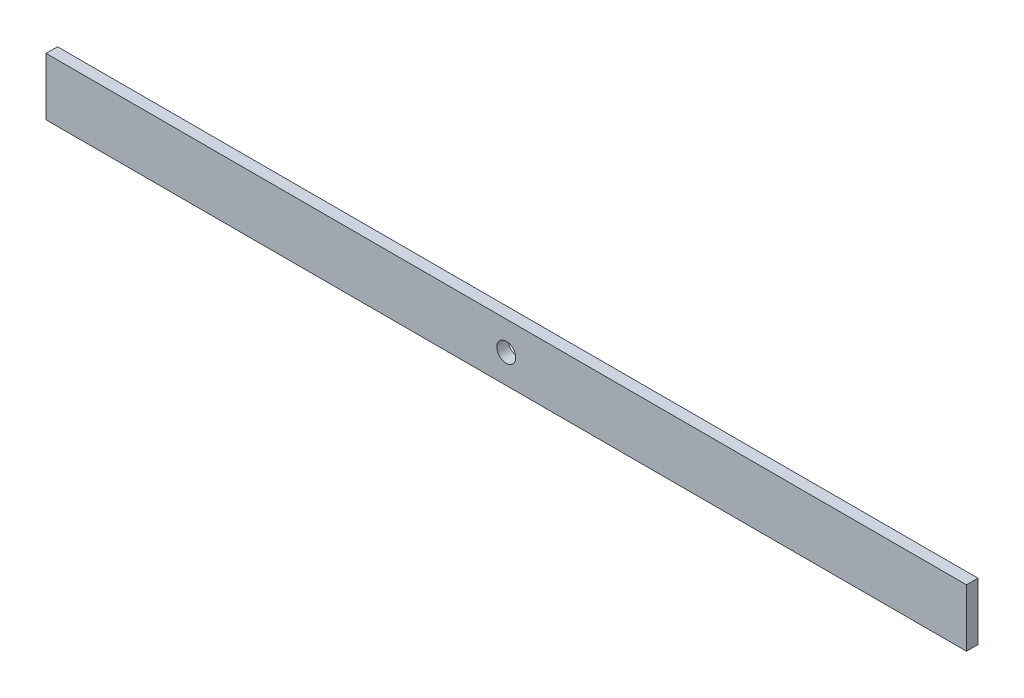
ISO-10303-21;
HEADER;
FILE_DESCRIPTION(('STEP AP214'),'2;1');
FILE_NAME('part.step','',(''),(''),'','','');
FILE_SCHEMA(('AUTOMOTIVE_DESIGN { 1 0 10303 214 1 1 1 1 }'));
ENDSEC;
DATA;
#1=APPLICATION_CONTEXT('core data for automotive mechanical design processes');
#2=APPLICATION_PROTOCOL_DEFINITION('international standard','automotive_design',2000,#1);
#3=PRODUCT_CONTEXT('',#1,'mechanical');
#4=PRODUCT('Part','Part','',(#3));
#5=PRODUCT_RELATED_PRODUCT_CATEGORY('part','',(#4));
#6=PRODUCT_DEFINITION_FORMATION('','',#4);
#7=PRODUCT_DEFINITION_CONTEXT('part definition',#1,'design');
#8=PRODUCT_DEFINITION('design','',#6,#7);
#9=PRODUCT_DEFINITION_SHAPE('','',#8);
#10=(LENGTH_UNIT() NAMED_UNIT(*) SI_UNIT(.MILLI.,.METRE.));
#11=(NAMED_UNIT(*) PLANE_ANGLE_UNIT() SI_UNIT($,.RADIAN.));
#12=(NAMED_UNIT(*) SI_UNIT($,.STERADIAN.) SOLID_ANGLE_UNIT());
#13=UNCERTAINTY_MEASURE_WITH_UNIT(LENGTH_MEASURE(1.E-05),#10,'distance_accuracy_value','');
#14=(GEOMETRIC_REPRESENTATION_CONTEXT(3) GLOBAL_UNCERTAINTY_ASSIGNED_CONTEXT((#13)) GLOBAL_UNIT_ASSIGNED_CONTEXT((#10,
#11,#12)) REPRESENTATION_CONTEXT('',''));
#15=CARTESIAN_POINT('',(0.,0.,0.));
#16=DIRECTION('',(0.,0.,1.));
#17=DIRECTION('',(1.,0.,0.));
#18=AXIS2_PLACEMENT_3D('',#15,#16,#17);
#19=CARTESIAN_POINT('',(80.,5.,-2.));
#20=DIRECTION('',(1.,0.,0.));
#21=DIRECTION('',(0.,0.,-1.));
#22=AXIS2_PLACEMENT_3D('',#19,#20,#21);
#23=PLANE('',#22);
#24=DIRECTION('',(0.,1.,0.));
#25=VECTOR('',#24,1.);
#26=CARTESIAN_POINT('',(80.,5.,0.));
#27=LINE('',#26,#25);
#28=CARTESIAN_POINT('',(80.,-5.,0.));
#29=VERTEX_POINT('',#28);
#30=CARTESIAN_POINT('',(80.,5.,0.));
#31=VERTEX_POINT('',#30);
#32=EDGE_CURVE('E106',#29,#31,#27,.T.);
#33=ORIENTED_EDGE('',*,*,#32,.F.);
#34=DIRECTION('',(0.,0.,1.));
#35=VECTOR('',#34,1.);
#36=CARTESIAN_POINT('',(80.,-5.,-2.));
#37=LINE('',#36,#35);
#38=CARTESIAN_POINT('',(80.,-5.,-2.));
#39=VERTEX_POINT('',#38);
#40=EDGE_CURVE('E11',#39,#29,#37,.T.);
#41=ORIENTED_EDGE('',*,*,#40,.F.);
#42=DIRECTION('',(0.,1.,0.));
#43=VECTOR('',#42,1.);
#44=CARTESIAN_POINT('',(80.,5.,-2.));
#45=LINE('',#44,#43);
#46=CARTESIAN_POINT('',(80.,5.,-2.));
#47=VERTEX_POINT('',#46);
#48=EDGE_CURVE('E99',#39,#47,#45,.T.);
#49=ORIENTED_EDGE('',*,*,#48,.T.);
#50=DIRECTION('',(0.,0.,1.));
#51=VECTOR('',#50,1.);
#52=CARTESIAN_POINT('',(80.,5.,-2.));
#53=LINE('',#52,#51);
#54=EDGE_CURVE('E44',#47,#31,#53,.T.);
#55=ORIENTED_EDGE('',*,*,#54,.T.);
#56=EDGE_LOOP('',(#33,#41,#49,#55));
#57=FACE_BOUND('',#56,.T.);
#58=ADVANCED_FACE('F41',(#57),#23,.T.);
#59=CARTESIAN_POINT('',(-80.,-5.,-2.));
#60=DIRECTION('',(0.,-1.,0.));
#61=DIRECTION('',(0.,0.,-1.));
#62=AXIS2_PLACEMENT_3D('',#59,#60,#61);
#63=PLANE('',#62);
#64=DIRECTION('',(1.,0.,0.));
#65=VECTOR('',#64,1.);
#66=CARTESIAN_POINT('',(-80.,-5.,0.));
#67=LINE('',#66,#65);
#68=CARTESIAN_POINT('',(-80.,-5.,0.));
#69=VERTEX_POINT('',#68);
#70=EDGE_CURVE('E101',#69,#29,#67,.T.);
#71=ORIENTED_EDGE('',*,*,#70,.F.);
#72=DIRECTION('',(0.,0.,1.));
#73=VECTOR('',#72,1.);
#74=CARTESIAN_POINT('',(-80.,-5.,-2.));
#75=LINE('',#74,#73);
#76=CARTESIAN_POINT('',(-80.,-5.,-2.));
#77=VERTEX_POINT('',#76);
#78=EDGE_CURVE('E50',#77,#69,#75,.T.);
#79=ORIENTED_EDGE('',*,*,#78,.F.);
#80=DIRECTION('',(1.,0.,0.));
#81=VECTOR('',#80,1.);
#82=CARTESIAN_POINT('',(-80.,-5.,-2.));
#83=LINE('',#82,#81);
#84=EDGE_CURVE('E96',#77,#39,#83,.T.);
#85=ORIENTED_EDGE('',*,*,#84,.T.);
#86=ORIENTED_EDGE('',*,*,#40,.T.);
#87=EDGE_LOOP('',(#71,#79,#85,#86));
#88=FACE_BOUND('',#87,.T.);
#89=ADVANCED_FACE('F117',(#88),#63,.T.);
#90=CARTESIAN_POINT('',(-80.,5.,-2.));
#91=DIRECTION('',(-1.,0.,0.));
#92=DIRECTION('',(0.,0.,1.));
#93=AXIS2_PLACEMENT_3D('',#90,#91,#92);
#94=PLANE('',#93);
#95=DIRECTION('',(0.,-1.,0.));
#96=VECTOR('',#95,1.);
#97=CARTESIAN_POINT('',(-80.,5.,0.));
#98=LINE('',#97,#96);
#99=CARTESIAN_POINT('',(-80.,5.,0.));
#100=VERTEX_POINT('',#99);
#101=EDGE_CURVE('E91',#100,#69,#98,.T.);
#102=ORIENTED_EDGE('',*,*,#101,.F.);
#103=DIRECTION('',(0.,0.,1.));
#104=VECTOR('',#103,1.);
#105=CARTESIAN_POINT('',(-80.,5.,-2.));
#106=LINE('',#105,#104);
#107=CARTESIAN_POINT('',(-80.,5.,-2.));
#108=VERTEX_POINT('',#107);
#109=EDGE_CURVE('E86',#108,#100,#106,.T.);
#110=ORIENTED_EDGE('',*,*,#109,.F.);
#111=DIRECTION('',(0.,-1.,0.));
#112=VECTOR('',#111,1.);
#113=CARTESIAN_POINT('',(-80.,5.,-2.));
#114=LINE('',#113,#112);
#115=EDGE_CURVE('E89',#108,#77,#114,.T.);
#116=ORIENTED_EDGE('',*,*,#115,.T.);
#117=ORIENTED_EDGE('',*,*,#78,.T.);
#118=EDGE_LOOP('',(#102,#110,#116,#117));
#119=FACE_BOUND('',#118,.T.);
#120=ADVANCED_FACE('F88',(#119),#94,.T.);
#121=CARTESIAN_POINT('',(-80.,5.,-2.));
#122=DIRECTION('',(0.,1.,0.));
#123=DIRECTION('',(0.,0.,1.));
#124=AXIS2_PLACEMENT_3D('',#121,#122,#123);
#125=PLANE('',#124);
#126=DIRECTION('',(-1.,0.,0.));
#127=VECTOR('',#126,1.);
#128=CARTESIAN_POINT('',(-80.,5.,0.));
#129=LINE('',#128,#127);
#130=EDGE_CURVE('E109',#31,#100,#129,.T.);
#131=ORIENTED_EDGE('',*,*,#130,.F.);
#132=ORIENTED_EDGE('',*,*,#54,.F.);
#133=DIRECTION('',(-1.,0.,0.));
#134=VECTOR('',#133,1.);
#135=CARTESIAN_POINT('',(-80.,5.,-2.));
#136=LINE('',#135,#134);
#137=EDGE_CURVE('E95',#47,#108,#136,.T.);
#138=ORIENTED_EDGE('',*,*,#137,.T.);
#139=ORIENTED_EDGE('',*,*,#109,.T.);
#140=EDGE_LOOP('',(#131,#132,#138,#139));
#141=FACE_BOUND('',#140,.T.);
#142=ADVANCED_FACE('F98',(#141),#125,.T.);
#143=CARTESIAN_POINT('',(0.,0.,-2.));
#144=DIRECTION('',(0.,0.,1.));
#145=DIRECTION('',(1.,0.,0.));
#146=AXIS2_PLACEMENT_3D('',#143,#144,#145);
#147=PLANE('',#146);
#148=CARTESIAN_POINT('',(0.,0.,-2.));
#149=DIRECTION('',(0.,0.,-1.));
#150=DIRECTION('',(-1.,0.,0.));
#151=AXIS2_PLACEMENT_3D('',#148,#149,#150);
#152=CIRCLE('',#151,1.65);
#153=CARTESIAN_POINT('',(-1.65,0.,-2.));
#154=VERTEX_POINT('',#153);
#155=EDGE_CURVE('E147',#154,#154,#152,.T.);
#156=ORIENTED_EDGE('',*,*,#155,.F.);
#157=EDGE_LOOP('',(#156));
#158=FACE_BOUND('',#157,.T.);
#159=ORIENTED_EDGE('',*,*,#48,.F.);
#160=ORIENTED_EDGE('',*,*,#84,.F.);
#161=ORIENTED_EDGE('',*,*,#115,.F.);
#162=ORIENTED_EDGE('',*,*,#137,.F.);
#163=EDGE_LOOP('',(#159,#160,#161,#162));
#164=FACE_BOUND('',#163,.T.);
#165=ADVANCED_FACE('F94',(#158,#164),#147,.F.);
#166=CARTESIAN_POINT('',(0.,0.,0.));
#167=DIRECTION('',(0.,0.,1.));
#168=DIRECTION('',(1.,0.,0.));
#169=AXIS2_PLACEMENT_3D('',#166,#167,#168);
#170=PLANE('',#169);
#171=CARTESIAN_POINT('',(0.,0.,0.));
#172=DIRECTION('',(0.,0.,1.));
#173=DIRECTION('',(1.,0.,0.));
#174=AXIS2_PLACEMENT_3D('',#171,#172,#173);
#175=CIRCLE('',#174,1.65);
#176=CARTESIAN_POINT('',(1.65,0.,0.));
#177=VERTEX_POINT('',#176);
#178=EDGE_CURVE('E110',#177,#177,#175,.T.);
#179=ORIENTED_EDGE('',*,*,#178,.F.);
#180=EDGE_LOOP('',(#179));
#181=FACE_BOUND('',#180,.T.);
#182=ORIENTED_EDGE('',*,*,#32,.T.);
#183=ORIENTED_EDGE('',*,*,#130,.T.);
#184=ORIENTED_EDGE('',*,*,#101,.T.);
#185=ORIENTED_EDGE('',*,*,#70,.T.);
#186=EDGE_LOOP('',(#182,#183,#184,#185));
#187=FACE_BOUND('',#186,.T.);
#188=ADVANCED_FACE('F116',(#181,#187),#170,.T.);
#189=CARTESIAN_POINT('',(0.,0.,-2.));
#190=DIRECTION('',(0.,0.,-1.));
#191=DIRECTION('',(-1.,0.,0.));
#192=AXIS2_PLACEMENT_3D('',#189,#190,#191);
#193=CYLINDRICAL_SURFACE('',#192,1.65);
#194=ORIENTED_EDGE('',*,*,#178,.T.);
#195=EDGE_LOOP('',(#194));
#196=FACE_BOUND('',#195,.T.);
#197=ORIENTED_EDGE('',*,*,#155,.T.);
#198=EDGE_LOOP('',(#197));
#199=FACE_BOUND('',#198,.T.);
#200=ADVANCED_FACE('F135',(#196,#199),#193,.F.);
#201=CLOSED_SHELL('',(#58,#89,#120,#142,#165,#188,#200));
#202=MANIFOLD_SOLID_BREP('B2',#201);
#203=ADVANCED_BREP_SHAPE_REPRESENTATION('',(#18,#202),#14);
#204=SHAPE_DEFINITION_REPRESENTATION(#9,#203);
ENDSEC;
END-ISO-10303-21;
